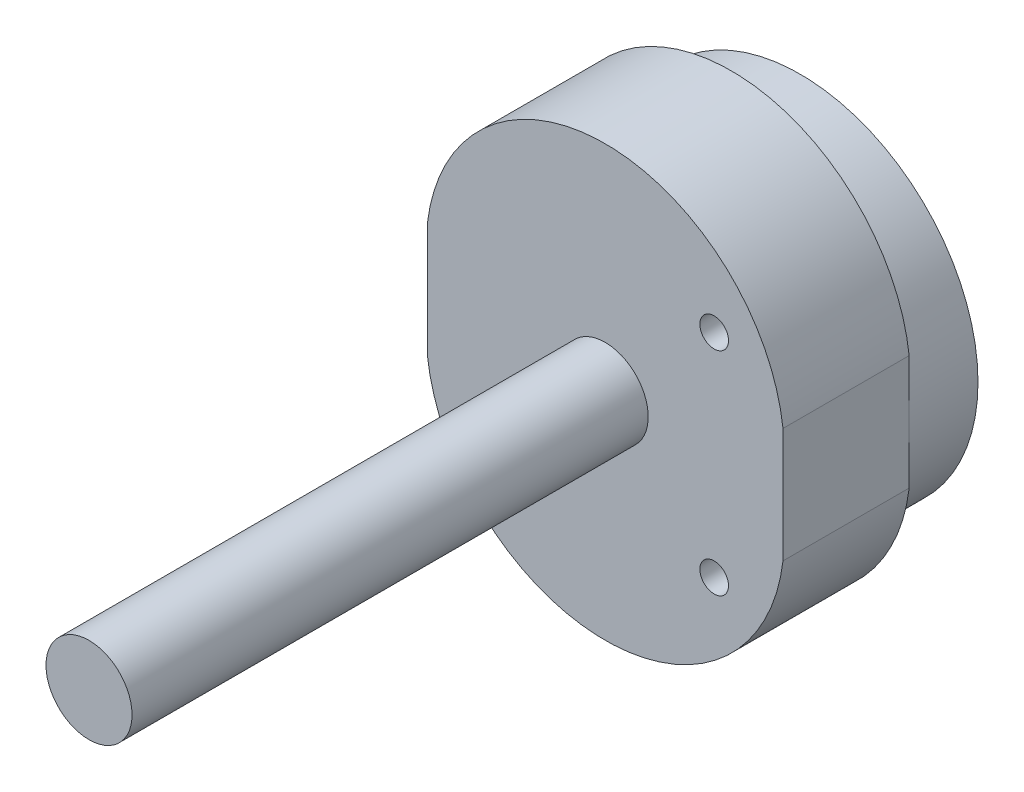
ISO-10303-21;
HEADER;
FILE_DESCRIPTION(('STEP AP214'),'2;1');
FILE_NAME('part.step','',(''),(''),'','','');
FILE_SCHEMA(('AUTOMOTIVE_DESIGN { 1 0 10303 214 1 1 1 1 }'));
ENDSEC;
DATA;
#1=APPLICATION_CONTEXT('core data for automotive mechanical design processes');
#2=APPLICATION_PROTOCOL_DEFINITION('international standard','automotive_design',2000,#1);
#3=PRODUCT_CONTEXT('',#1,'mechanical');
#4=PRODUCT('Part','Part','',(#3));
#5=PRODUCT_RELATED_PRODUCT_CATEGORY('part','',(#4));
#6=PRODUCT_DEFINITION_FORMATION('','',#4);
#7=PRODUCT_DEFINITION_CONTEXT('part definition',#1,'design');
#8=PRODUCT_DEFINITION('design','',#6,#7);
#9=PRODUCT_DEFINITION_SHAPE('','',#8);
#10=(LENGTH_UNIT() NAMED_UNIT(*) SI_UNIT(.MILLI.,.METRE.));
#11=(NAMED_UNIT(*) PLANE_ANGLE_UNIT() SI_UNIT($,.RADIAN.));
#12=(NAMED_UNIT(*) SI_UNIT($,.STERADIAN.) SOLID_ANGLE_UNIT());
#13=UNCERTAINTY_MEASURE_WITH_UNIT(LENGTH_MEASURE(1.E-05),#10,'distance_accuracy_value','');
#14=(GEOMETRIC_REPRESENTATION_CONTEXT(3) GLOBAL_UNCERTAINTY_ASSIGNED_CONTEXT((#13)) GLOBAL_UNIT_ASSIGNED_CONTEXT((#10,
#11,#12)) REPRESENTATION_CONTEXT('',''));
#15=CARTESIAN_POINT('',(0.,0.,0.));
#16=DIRECTION('',(0.,0.,1.));
#17=DIRECTION('',(1.,0.,0.));
#18=AXIS2_PLACEMENT_3D('',#15,#16,#17);
#19=CARTESIAN_POINT('',(0.,6.27727272727272,0.));
#20=DIRECTION('',(0.,0.,-1.));
#21=DIRECTION('',(-1.,0.,0.));
#22=AXIS2_PLACEMENT_3D('',#19,#20,#21);
#23=PLANE('',#22);
#24=CARTESIAN_POINT('',(0.,0.,0.));
#25=DIRECTION('',(0.,0.,-1.));
#26=DIRECTION('',(-1.,0.,0.));
#27=AXIS2_PLACEMENT_3D('',#24,#25,#26);
#28=CIRCLE('',#27,31.);
#29=CARTESIAN_POINT('',(-31.,0.,0.));
#30=VERTEX_POINT('',#29);
#31=CARTESIAN_POINT('',(31.,0.,0.));
#32=VERTEX_POINT('',#31);
#33=EDGE_CURVE('E103',#30,#32,#28,.T.);
#34=ORIENTED_EDGE('',*,*,#33,.F.);
#35=DIRECTION('',(0.,-1.,0.));
#36=VECTOR('',#35,1.);
#37=CARTESIAN_POINT('',(-31.,-10.,0.));
#38=LINE('',#37,#36);
#39=CARTESIAN_POINT('',(-31.,10.,0.));
#40=VERTEX_POINT('',#39);
#41=EDGE_CURVE('E87',#40,#30,#38,.T.);
#42=ORIENTED_EDGE('',*,*,#41,.F.);
#43=CARTESIAN_POINT('',(0.,6.27727272727272,0.));
#44=DIRECTION('',(0.,0.,1.));
#45=DIRECTION('',(-1.,0.,0.));
#46=AXIS2_PLACEMENT_3D('',#43,#44,#45);
#47=CIRCLE('',#46,31.2227272727273);
#48=CARTESIAN_POINT('',(31.,10.,0.));
#49=VERTEX_POINT('',#48);
#50=EDGE_CURVE('E101',#49,#40,#47,.T.);
#51=ORIENTED_EDGE('',*,*,#50,.F.);
#52=DIRECTION('',(0.,1.,0.));
#53=VECTOR('',#52,1.);
#54=CARTESIAN_POINT('',(31.,-10.,0.));
#55=LINE('',#54,#53);
#56=EDGE_CURVE('E76',#32,#49,#55,.T.);
#57=ORIENTED_EDGE('',*,*,#56,.F.);
#58=EDGE_LOOP('',(#34,#42,#51,#57));
#59=FACE_BOUND('',#58,.T.);
#60=ADVANCED_FACE('F33',(#59),#23,.T.);
#61=CARTESIAN_POINT('',(0.,6.27727272727272,22.));
#62=DIRECTION('',(0.,0.,-1.));
#63=DIRECTION('',(-1.,0.,0.));
#64=AXIS2_PLACEMENT_3D('',#61,#62,#63);
#65=CYLINDRICAL_SURFACE('',#64,31.2227272727273);
#66=ORIENTED_EDGE('',*,*,#50,.T.);
#67=DIRECTION('',(0.,0.,-1.));
#68=VECTOR('',#67,1.);
#69=CARTESIAN_POINT('',(-31.,10.,22.));
#70=LINE('',#69,#68);
#71=CARTESIAN_POINT('',(-31.,10.,22.));
#72=VERTEX_POINT('',#71);
#73=EDGE_CURVE('E92',#72,#40,#70,.T.);
#74=ORIENTED_EDGE('',*,*,#73,.F.);
#75=CARTESIAN_POINT('',(0.,6.27727272727272,22.));
#76=DIRECTION('',(0.,0.,1.));
#77=DIRECTION('',(-1.,0.,0.));
#78=AXIS2_PLACEMENT_3D('',#75,#76,#77);
#79=CIRCLE('',#78,31.2227272727273);
#80=CARTESIAN_POINT('',(31.,10.,22.));
#81=VERTEX_POINT('',#80);
#82=EDGE_CURVE('E113',#81,#72,#79,.T.);
#83=ORIENTED_EDGE('',*,*,#82,.F.);
#84=DIRECTION('',(0.,0.,-1.));
#85=VECTOR('',#84,1.);
#86=CARTESIAN_POINT('',(31.,10.,22.));
#87=LINE('',#86,#85);
#88=EDGE_CURVE('E120',#81,#49,#87,.T.);
#89=ORIENTED_EDGE('',*,*,#88,.T.);
#90=EDGE_LOOP('',(#66,#74,#83,#89));
#91=FACE_BOUND('',#90,.T.);
#92=ADVANCED_FACE('F35',(#91),#65,.T.);
#93=CARTESIAN_POINT('',(-31.,-10.,22.));
#94=DIRECTION('',(1.,0.,0.));
#95=DIRECTION('',(0.,0.,-1.));
#96=AXIS2_PLACEMENT_3D('',#93,#94,#95);
#97=PLANE('',#96);
#98=ORIENTED_EDGE('',*,*,#41,.T.);
#99=CARTESIAN_POINT('',(-31.,-10.,0.));
#100=VERTEX_POINT('',#99);
#101=EDGE_CURVE('E89',#30,#100,#38,.T.);
#102=ORIENTED_EDGE('',*,*,#101,.T.);
#103=DIRECTION('',(0.,0.,-1.));
#104=VECTOR('',#103,1.);
#105=CARTESIAN_POINT('',(-31.,-10.,22.));
#106=LINE('',#105,#104);
#107=CARTESIAN_POINT('',(-31.,-10.,22.));
#108=VERTEX_POINT('',#107);
#109=EDGE_CURVE('E109',#108,#100,#106,.T.);
#110=ORIENTED_EDGE('',*,*,#109,.F.);
#111=DIRECTION('',(0.,-1.,0.));
#112=VECTOR('',#111,1.);
#113=CARTESIAN_POINT('',(-31.,-10.,22.));
#114=LINE('',#113,#112);
#115=EDGE_CURVE('E84',#72,#108,#114,.T.);
#116=ORIENTED_EDGE('',*,*,#115,.F.);
#117=ORIENTED_EDGE('',*,*,#73,.T.);
#118=EDGE_LOOP('',(#98,#102,#110,#116,#117));
#119=FACE_BOUND('',#118,.T.);
#120=ADVANCED_FACE('F88',(#119),#97,.F.);
#121=CARTESIAN_POINT('',(0.,-6.27727272727272,22.));
#122=DIRECTION('',(0.,0.,-1.));
#123=DIRECTION('',(-1.,0.,0.));
#124=AXIS2_PLACEMENT_3D('',#121,#122,#123);
#125=CYLINDRICAL_SURFACE('',#124,31.2227272727273);
#126=CARTESIAN_POINT('',(0.,-6.27727272727272,0.));
#127=DIRECTION('',(0.,0.,1.));
#128=DIRECTION('',(1.,0.,0.));
#129=AXIS2_PLACEMENT_3D('',#126,#127,#128);
#130=CIRCLE('',#129,31.2227272727273);
#131=CARTESIAN_POINT('',(31.,-10.,0.));
#132=VERTEX_POINT('',#131);
#133=EDGE_CURVE('E97',#100,#132,#130,.T.);
#134=ORIENTED_EDGE('',*,*,#133,.T.);
#135=DIRECTION('',(0.,0.,-1.));
#136=VECTOR('',#135,1.);
#137=CARTESIAN_POINT('',(31.,-10.,22.));
#138=LINE('',#137,#136);
#139=CARTESIAN_POINT('',(31.,-10.,22.));
#140=VERTEX_POINT('',#139);
#141=EDGE_CURVE('E125',#140,#132,#138,.T.);
#142=ORIENTED_EDGE('',*,*,#141,.F.);
#143=CARTESIAN_POINT('',(0.,-6.27727272727272,22.));
#144=DIRECTION('',(0.,0.,1.));
#145=DIRECTION('',(1.,0.,0.));
#146=AXIS2_PLACEMENT_3D('',#143,#144,#145);
#147=CIRCLE('',#146,31.2227272727273);
#148=EDGE_CURVE('E117',#108,#140,#147,.T.);
#149=ORIENTED_EDGE('',*,*,#148,.F.);
#150=ORIENTED_EDGE('',*,*,#109,.T.);
#151=EDGE_LOOP('',(#134,#142,#149,#150));
#152=FACE_BOUND('',#151,.T.);
#153=ADVANCED_FACE('F130',(#152),#125,.T.);
#154=CARTESIAN_POINT('',(31.,-10.,22.));
#155=DIRECTION('',(-1.,0.,0.));
#156=DIRECTION('',(0.,0.,1.));
#157=AXIS2_PLACEMENT_3D('',#154,#155,#156);
#158=PLANE('',#157);
#159=EDGE_CURVE('E115',#132,#32,#55,.T.);
#160=ORIENTED_EDGE('',*,*,#159,.T.);
#161=ORIENTED_EDGE('',*,*,#56,.T.);
#162=ORIENTED_EDGE('',*,*,#88,.F.);
#163=DIRECTION('',(0.,1.,0.));
#164=VECTOR('',#163,1.);
#165=CARTESIAN_POINT('',(31.,-10.,22.));
#166=LINE('',#165,#164);
#167=EDGE_CURVE('E56',#140,#81,#166,.T.);
#168=ORIENTED_EDGE('',*,*,#167,.F.);
#169=ORIENTED_EDGE('',*,*,#141,.T.);
#170=EDGE_LOOP('',(#160,#161,#162,#168,#169));
#171=FACE_BOUND('',#170,.T.);
#172=ADVANCED_FACE('F135',(#171),#158,.F.);
#173=CARTESIAN_POINT('',(0.,6.27727272727272,22.));
#174=DIRECTION('',(0.,0.,-1.));
#175=DIRECTION('',(-1.,0.,0.));
#176=AXIS2_PLACEMENT_3D('',#173,#174,#175);
#177=PLANE('',#176);
#178=CARTESIAN_POINT('',(0.,0.,22.));
#179=DIRECTION('',(0.,0.,-1.));
#180=DIRECTION('',(-1.,0.,0.));
#181=AXIS2_PLACEMENT_3D('',#178,#179,#180);
#182=CIRCLE('',#181,7.5);
#183=CARTESIAN_POINT('',(-7.5,0.,22.));
#184=VERTEX_POINT('',#183);
#185=EDGE_CURVE('E11',#184,#184,#182,.F.);
#186=ORIENTED_EDGE('',*,*,#185,.F.);
#187=EDGE_LOOP('',(#186));
#188=FACE_BOUND('',#187,.T.);
#189=CARTESIAN_POINT('',(19.,-18.5,22.));
#190=DIRECTION('',(0.,0.,1.));
#191=DIRECTION('',(1.,0.,0.));
#192=AXIS2_PLACEMENT_3D('',#189,#190,#191);
#193=CIRCLE('',#192,2.5);
#194=CARTESIAN_POINT('',(21.5,-18.5,22.));
#195=VERTEX_POINT('',#194);
#196=EDGE_CURVE('E192',#195,#195,#193,.T.);
#197=ORIENTED_EDGE('',*,*,#196,.F.);
#198=EDGE_LOOP('',(#197));
#199=FACE_BOUND('',#198,.T.);
#200=CARTESIAN_POINT('',(19.,18.5,22.));
#201=DIRECTION('',(0.,0.,1.));
#202=DIRECTION('',(1.,0.,0.));
#203=AXIS2_PLACEMENT_3D('',#200,#201,#202);
#204=CIRCLE('',#203,2.5);
#205=CARTESIAN_POINT('',(21.5,18.5,22.));
#206=VERTEX_POINT('',#205);
#207=EDGE_CURVE('E199',#206,#206,#204,.T.);
#208=ORIENTED_EDGE('',*,*,#207,.F.);
#209=EDGE_LOOP('',(#208));
#210=FACE_BOUND('',#209,.T.);
#211=ORIENTED_EDGE('',*,*,#82,.T.);
#212=ORIENTED_EDGE('',*,*,#115,.T.);
#213=ORIENTED_EDGE('',*,*,#148,.T.);
#214=ORIENTED_EDGE('',*,*,#167,.T.);
#215=EDGE_LOOP('',(#211,#212,#213,#214));
#216=FACE_BOUND('',#215,.T.);
#217=ADVANCED_FACE('F132',(#188,#199,#210,#216),#177,.F.);
#218=EDGE_CURVE('E41',#32,#30,#28,.T.);
#219=ORIENTED_EDGE('',*,*,#218,.F.);
#220=ORIENTED_EDGE('',*,*,#159,.F.);
#221=ORIENTED_EDGE('',*,*,#133,.F.);
#222=ORIENTED_EDGE('',*,*,#101,.F.);
#223=EDGE_LOOP('',(#219,#220,#221,#222));
#224=FACE_BOUND('',#223,.T.);
#225=ADVANCED_FACE('F100',(#224),#23,.T.);
#226=CARTESIAN_POINT('',(0.,0.,-12.));
#227=DIRECTION('',(0.,0.,1.));
#228=DIRECTION('',(1.,0.,0.));
#229=AXIS2_PLACEMENT_3D('',#226,#227,#228);
#230=CYLINDRICAL_SURFACE('',#229,31.);
#231=CARTESIAN_POINT('',(0.,0.,-12.));
#232=DIRECTION('',(0.,0.,-1.));
#233=DIRECTION('',(-1.,0.,0.));
#234=AXIS2_PLACEMENT_3D('',#231,#232,#233);
#235=CIRCLE('',#234,31.);
#236=CARTESIAN_POINT('',(-31.,0.,-12.));
#237=VERTEX_POINT('',#236);
#238=EDGE_CURVE('E105',#237,#237,#235,.T.);
#239=ORIENTED_EDGE('',*,*,#238,.F.);
#240=EDGE_LOOP('',(#239));
#241=FACE_BOUND('',#240,.T.);
#242=ORIENTED_EDGE('',*,*,#33,.T.);
#243=ORIENTED_EDGE('',*,*,#218,.T.);
#244=EDGE_LOOP('',(#242,#243));
#245=FACE_BOUND('',#244,.T.);
#246=ADVANCED_FACE('F108',(#241,#245),#230,.T.);
#247=CARTESIAN_POINT('',(0.,0.,-12.));
#248=DIRECTION('',(0.,0.,-1.));
#249=DIRECTION('',(-1.,0.,0.));
#250=AXIS2_PLACEMENT_3D('',#247,#248,#249);
#251=PLANE('',#250);
#252=ORIENTED_EDGE('',*,*,#238,.T.);
#253=EDGE_LOOP('',(#252));
#254=FACE_BOUND('',#253,.T.);
#255=ADVANCED_FACE('F154',(#254),#251,.T.);
#256=CARTESIAN_POINT('',(19.,18.5,10.));
#257=DIRECTION('',(0.,0.,1.));
#258=DIRECTION('',(1.,0.,0.));
#259=AXIS2_PLACEMENT_3D('',#256,#257,#258);
#260=CYLINDRICAL_SURFACE('',#259,2.5);
#261=CARTESIAN_POINT('',(19.,18.5,10.));
#262=DIRECTION('',(0.,0.,1.));
#263=DIRECTION('',(1.,0.,0.));
#264=AXIS2_PLACEMENT_3D('',#261,#262,#263);
#265=CIRCLE('',#264,2.5);
#266=CARTESIAN_POINT('',(21.5,18.5,10.));
#267=VERTEX_POINT('',#266);
#268=EDGE_CURVE('E106',#267,#267,#265,.T.);
#269=ORIENTED_EDGE('',*,*,#268,.F.);
#270=EDGE_LOOP('',(#269));
#271=FACE_BOUND('',#270,.T.);
#272=ORIENTED_EDGE('',*,*,#207,.T.);
#273=EDGE_LOOP('',(#272));
#274=FACE_BOUND('',#273,.T.);
#275=ADVANCED_FACE('F160',(#271,#274),#260,.F.);
#276=CARTESIAN_POINT('',(19.,18.5,10.));
#277=DIRECTION('',(0.,0.,1.));
#278=DIRECTION('',(1.,0.,0.));
#279=AXIS2_PLACEMENT_3D('',#276,#277,#278);
#280=PLANE('',#279);
#281=ORIENTED_EDGE('',*,*,#268,.T.);
#282=EDGE_LOOP('',(#281));
#283=FACE_BOUND('',#282,.T.);
#284=ADVANCED_FACE('F167',(#283),#280,.T.);
#285=CARTESIAN_POINT('',(19.,-18.5,10.));
#286=DIRECTION('',(0.,0.,1.));
#287=DIRECTION('',(1.,0.,0.));
#288=AXIS2_PLACEMENT_3D('',#285,#286,#287);
#289=CYLINDRICAL_SURFACE('',#288,2.5);
#290=CARTESIAN_POINT('',(19.,-18.5,10.));
#291=DIRECTION('',(0.,0.,1.));
#292=DIRECTION('',(1.,0.,0.));
#293=AXIS2_PLACEMENT_3D('',#290,#291,#292);
#294=CIRCLE('',#293,2.5);
#295=CARTESIAN_POINT('',(21.5,-18.5,10.));
#296=VERTEX_POINT('',#295);
#297=EDGE_CURVE('E195',#296,#296,#294,.T.);
#298=ORIENTED_EDGE('',*,*,#297,.F.);
#299=EDGE_LOOP('',(#298));
#300=FACE_BOUND('',#299,.T.);
#301=ORIENTED_EDGE('',*,*,#196,.T.);
#302=EDGE_LOOP('',(#301));
#303=FACE_BOUND('',#302,.T.);
#304=ADVANCED_FACE('F171',(#300,#303),#289,.F.);
#305=CARTESIAN_POINT('',(19.,-18.5,10.));
#306=DIRECTION('',(0.,0.,1.));
#307=DIRECTION('',(1.,0.,0.));
#308=AXIS2_PLACEMENT_3D('',#305,#306,#307);
#309=PLANE('',#308);
#310=ORIENTED_EDGE('',*,*,#297,.T.);
#311=EDGE_LOOP('',(#310));
#312=FACE_BOUND('',#311,.T.);
#313=ADVANCED_FACE('F175',(#312),#309,.T.);
#314=CARTESIAN_POINT('',(0.,0.,112.));
#315=DIRECTION('',(0.,0.,-1.));
#316=DIRECTION('',(-1.,0.,0.));
#317=AXIS2_PLACEMENT_3D('',#314,#315,#316);
#318=CYLINDRICAL_SURFACE('',#317,7.5);
#319=CARTESIAN_POINT('',(0.,0.,112.));
#320=DIRECTION('',(0.,0.,1.));
#321=DIRECTION('',(1.,0.,0.));
#322=AXIS2_PLACEMENT_3D('',#319,#320,#321);
#323=CIRCLE('',#322,7.5);
#324=CARTESIAN_POINT('',(7.5,0.,112.));
#325=VERTEX_POINT('',#324);
#326=EDGE_CURVE('E191',#325,#325,#323,.T.);
#327=ORIENTED_EDGE('',*,*,#326,.F.);
#328=EDGE_LOOP('',(#327));
#329=FACE_BOUND('',#328,.T.);
#330=ORIENTED_EDGE('',*,*,#185,.T.);
#331=EDGE_LOOP('',(#330));
#332=FACE_BOUND('',#331,.T.);
#333=ADVANCED_FACE('F179',(#329,#332),#318,.T.);
#334=CARTESIAN_POINT('',(0.,0.,112.));
#335=DIRECTION('',(0.,0.,1.));
#336=DIRECTION('',(1.,0.,0.));
#337=AXIS2_PLACEMENT_3D('',#334,#335,#336);
#338=PLANE('',#337);
#339=ORIENTED_EDGE('',*,*,#326,.T.);
#340=EDGE_LOOP('',(#339));
#341=FACE_BOUND('',#340,.T.);
#342=ADVANCED_FACE('F183',(#341),#338,.T.);
#343=CLOSED_SHELL('',(#60,#92,#120,#153,#172,#217,#225,#246,#255,#275,#284,#304,#313,#333,#342));
#344=MANIFOLD_SOLID_BREP('B2',#343);
#345=ADVANCED_BREP_SHAPE_REPRESENTATION('',(#18,#344),#14);
#346=SHAPE_DEFINITION_REPRESENTATION(#9,#345);
ENDSEC;
END-ISO-10303-21;
